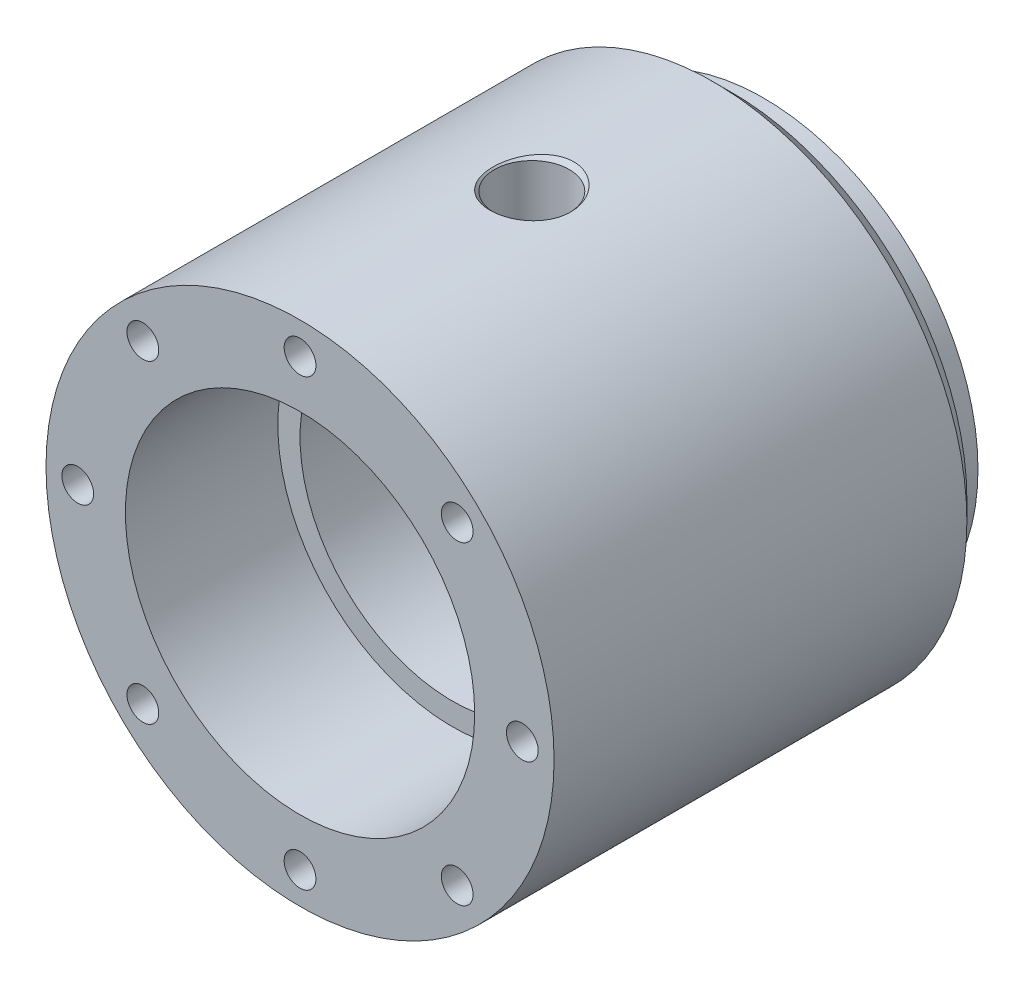
ISO-10303-21;
HEADER;
FILE_DESCRIPTION(('STEP AP214'),'2;1');
FILE_NAME('part.step','',(''),(''),'','','');
FILE_SCHEMA(('AUTOMOTIVE_DESIGN { 1 0 10303 214 1 1 1 1 }'));
ENDSEC;
DATA;
#1=APPLICATION_CONTEXT('core data for automotive mechanical design processes');
#2=APPLICATION_PROTOCOL_DEFINITION('international standard','automotive_design',2000,#1);
#3=PRODUCT_CONTEXT('',#1,'mechanical');
#4=PRODUCT('Part','Part','',(#3));
#5=PRODUCT_RELATED_PRODUCT_CATEGORY('part','',(#4));
#6=PRODUCT_DEFINITION_FORMATION('','',#4);
#7=PRODUCT_DEFINITION_CONTEXT('part definition',#1,'design');
#8=PRODUCT_DEFINITION('design','',#6,#7);
#9=PRODUCT_DEFINITION_SHAPE('','',#8);
#10=(LENGTH_UNIT() NAMED_UNIT(*) SI_UNIT(.MILLI.,.METRE.));
#11=(NAMED_UNIT(*) PLANE_ANGLE_UNIT() SI_UNIT($,.RADIAN.));
#12=(NAMED_UNIT(*) SI_UNIT($,.STERADIAN.) SOLID_ANGLE_UNIT());
#13=UNCERTAINTY_MEASURE_WITH_UNIT(LENGTH_MEASURE(1.E-05),#10,'distance_accuracy_value','');
#14=(GEOMETRIC_REPRESENTATION_CONTEXT(3) GLOBAL_UNCERTAINTY_ASSIGNED_CONTEXT((#13)) GLOBAL_UNIT_ASSIGNED_CONTEXT((#10,
#11,#12)) REPRESENTATION_CONTEXT('',''));
#15=CARTESIAN_POINT('',(0.,0.,0.));
#16=DIRECTION('',(0.,0.,1.));
#17=DIRECTION('',(1.,0.,0.));
#18=AXIS2_PLACEMENT_3D('',#15,#16,#17);
#19=CARTESIAN_POINT('',(0.,0.,-212.));
#20=DIRECTION('',(0.,0.,1.));
#21=DIRECTION('',(1.,0.,0.));
#22=AXIS2_PLACEMENT_3D('',#19,#20,#21);
#23=CONICAL_SURFACE('',#22,40.,0.785398163397448);
#24=CARTESIAN_POINT('',(0.,0.,-215.));
#25=DIRECTION('',(0.,0.,1.));
#26=DIRECTION('',(1.,0.,0.));
#27=AXIS2_PLACEMENT_3D('',#24,#25,#26);
#28=CIRCLE('',#27,36.9999999999999);
#29=CARTESIAN_POINT('',(36.9999999999999,0.,-215.));
#30=VERTEX_POINT('',#29);
#31=EDGE_CURVE('E132',#30,#30,#28,.T.);
#32=ORIENTED_EDGE('',*,*,#31,.T.);
#33=EDGE_LOOP('',(#32));
#34=FACE_BOUND('',#33,.T.);
#35=CARTESIAN_POINT('',(0.,0.,-212.));
#36=DIRECTION('',(0.,0.,1.));
#37=DIRECTION('',(1.,0.,0.));
#38=AXIS2_PLACEMENT_3D('',#35,#36,#37);
#39=CIRCLE('',#38,40.);
#40=CARTESIAN_POINT('',(40.,0.,-212.));
#41=VERTEX_POINT('',#40);
#42=EDGE_CURVE('E55',#41,#41,#39,.T.);
#43=ORIENTED_EDGE('',*,*,#42,.F.);
#44=EDGE_LOOP('',(#43));
#45=FACE_BOUND('',#44,.T.);
#46=ADVANCED_FACE('F44',(#34,#45),#23,.T.);
#47=CARTESIAN_POINT('',(0.,0.,0.));
#48=DIRECTION('',(0.,0.,1.));
#49=DIRECTION('',(1.,0.,0.));
#50=AXIS2_PLACEMENT_3D('',#47,#48,#49);
#51=CYLINDRICAL_SURFACE('',#50,40.);
#52=CARTESIAN_POINT('',(-4.46134364212804,39.7504265757624,-188.024245332228));
#53=CARTESIAN_POINT('',(-4.2547141816658,39.7736161133025,-188.260572684038));
#54=CARTESIAN_POINT('',(-4.03082984463506,39.797113352208,-188.48179628135));
#55=CARTESIAN_POINT('',(-3.55216918402587,39.8426890440379,-188.8882788173));
#56=CARTESIAN_POINT('',(-3.297383191654,39.8647670495763,-189.073526452043));
#57=CARTESIAN_POINT('',(-2.72878346440296,39.9079497616791,-189.422552239188));
#58=CARTESIAN_POINT('',(-2.41156349817063,39.9286015775349,-189.580895861088));
#59=CARTESIAN_POINT('',(-1.75334984843986,39.9629092170703,-189.837819123665));
#60=CARTESIAN_POINT('',(-1.41235991328911,39.97656614097,-189.936408163532));
#61=CARTESIAN_POINT('',(-0.742271126527992,39.9944170464418,-190.064261687959));
#62=CARTESIAN_POINT('',(-0.41402271225562,39.9992090253901,-190.097914263758));
#63=CARTESIAN_POINT('',(0.243290831804951,40.0006087912287,-190.10779993532));
#64=CARTESIAN_POINT('',(0.572355665170004,39.9972192082096,-190.084051483533));
#65=CARTESIAN_POINT('',(1.20896924388255,39.9829471995885,-189.982255893571));
#66=CARTESIAN_POINT('',(1.5168613929282,39.9723522037988,-189.906290525314));
#67=CARTESIAN_POINT('',(2.11590653727902,39.9451239650923,-189.705405311372));
#68=CARTESIAN_POINT('',(2.40705802944452,39.9284901809317,-189.580481077528));
#69=CARTESIAN_POINT('',(2.97290995866227,39.890404842453,-189.282484526864));
#70=CARTESIAN_POINT('',(3.24698613284484,39.86883930596,-189.108245181803));
#71=CARTESIAN_POINT('',(3.76426884044054,39.8233328554193,-188.719078872961));
#72=CARTESIAN_POINT('',(4.00746686594397,39.7993912899237,-188.504140735837));
#73=CARTESIAN_POINT('',(4.47398735437385,39.7497456637844,-188.023946737192));
#74=CARTESIAN_POINT('',(4.69479203835397,39.724033645806,-187.75624673313));
#75=CARTESIAN_POINT('',(5.09191527121395,39.6750870050078,-187.189484067489));
#76=CARTESIAN_POINT('',(5.2682194534872,39.6518531836468,-186.890411321487));
#77=CARTESIAN_POINT('',(5.58430448623184,39.6086215986105,-186.246464763901));
#78=CARTESIAN_POINT('',(5.72058312653403,39.58897287278,-185.899845636628));
#79=CARTESIAN_POINT('',(5.93627220436257,39.5572065919993,-185.189013216111));
#80=CARTESIAN_POINT('',(6.01566930939089,39.5450908027866,-184.824795819338));
#81=CARTESIAN_POINT('',(6.11841965191092,39.5293292024138,-184.071892330637));
#82=CARTESIAN_POINT('',(6.13914037442043,39.5260814739157,-183.682836304256));
#83=CARTESIAN_POINT('',(6.11663547782751,39.5295695472691,-182.906592947823));
#84=CARTESIAN_POINT('',(6.07340167148822,39.5363066273414,-182.519405863393));
#85=CARTESIAN_POINT('',(5.92284104234674,39.5591430587532,-181.752874868312));
#86=CARTESIAN_POINT('',(5.81471628347002,39.5753589006642,-181.373690477837));
#87=CARTESIAN_POINT('',(5.53579255499811,39.6153346761331,-180.639451279513));
#88=CARTESIAN_POINT('',(5.3649915724394,39.6390948519879,-180.284397247089));
#89=CARTESIAN_POINT('',(4.96747134394483,39.6908504739135,-179.615233176384));
#90=CARTESIAN_POINT('',(4.74171129119167,39.7187703811253,-179.300548965661));
#91=CARTESIAN_POINT('',(4.23778291698224,39.7756865573392,-178.716372932709));
#92=CARTESIAN_POINT('',(3.95962889112602,39.8046825310096,-178.446868820994));
#93=CARTESIAN_POINT('',(3.37387314712637,39.8584834794532,-177.976679551526));
#94=CARTESIAN_POINT('',(3.06860478247559,39.8834289615974,-177.773109984601));
#95=CARTESIAN_POINT('',(2.42569108996126,39.9276774927417,-177.425033858409));
#96=CARTESIAN_POINT('',(2.08806586484318,39.9469840153307,-177.280490916903));
#97=CARTESIAN_POINT('',(1.41873013965092,39.9761235806351,-177.066330809292));
#98=CARTESIAN_POINT('',(1.08864441200703,39.9865824870408,-176.991713216379));
#99=CARTESIAN_POINT('',(0.420353911500709,39.999184523368,-176.902104061656));
#100=CARTESIAN_POINT('',(0.0821524470286135,40.0013309858129,-176.887088604826));
#101=CARTESIAN_POINT('',(-0.572371428752767,39.9971691604508,-176.916500055854));
#102=CARTESIAN_POINT('',(-0.888851527944951,39.9913311376005,-176.957620456177));
#103=CARTESIAN_POINT('',(-1.51036439405873,39.9726842879224,-177.091726652953));
#104=CARTESIAN_POINT('',(-1.8153973391307,39.9598755696267,-177.184711641888));
#105=CARTESIAN_POINT('',(-2.40748261943061,39.9285922357563,-177.419379167752));
#106=CARTESIAN_POINT('',(-2.69443749739054,39.910089629769,-177.561302705151));
#107=CARTESIAN_POINT('',(-3.24206572620764,39.8693433687359,-177.888572987024));
#108=CARTESIAN_POINT('',(-3.50273316694451,39.8470988753995,-178.073929465393));
#109=CARTESIAN_POINT('',(-4.00693498883101,39.7996531153112,-178.494188195738));
#110=CARTESIAN_POINT('',(-4.24856676591587,39.7743549429052,-178.731359355045));
#111=CARTESIAN_POINT('',(-4.69189073590679,39.7245017768864,-179.2405171025));
#112=CARTESIAN_POINT('',(-4.89356981559064,39.6999470295123,-179.512515073393));
#113=CARTESIAN_POINT('',(-5.26706236266682,39.6521906558315,-180.10547174891));
#114=CARTESIAN_POINT('',(-5.43551069791807,39.6292278606958,-180.428571259433));
#115=CARTESIAN_POINT('',(-5.71932720896481,39.5892648752238,-181.097631060611));
#116=CARTESIAN_POINT('',(-5.83468188164498,39.5722662019815,-181.44359714128));
#117=CARTESIAN_POINT('',(-6.01518059579964,39.5452463765131,-182.168961336997));
#118=CARTESIAN_POINT('',(-6.07721661785063,39.5356600554306,-182.549151850767));
#119=CARTESIAN_POINT('',(-6.13886246858546,39.5261348382669,-183.314740793126));
#120=CARTESIAN_POINT('',(-6.13845604353093,39.5261984540596,-183.700140551575));
#121=CARTESIAN_POINT('',(-6.07447984363853,39.5360820489496,-184.474387912181));
#122=CARTESIAN_POINT('',(-6.00947532051334,39.546123642294,-184.863114931827));
#123=CARTESIAN_POINT('',(-5.81537609752857,39.5751307034205,-185.623824159913));
#124=CARTESIAN_POINT('',(-5.68630635411572,39.5940926961332,-185.995812827243));
#125=CARTESIAN_POINT('',(-5.3913346070961,39.6352362027509,-186.656771626619));
#126=CARTESIAN_POINT('',(-5.23413864760716,39.656475418107,-186.949715672503));
#127=CARTESIAN_POINT('',(-4.87812840639666,39.7018389231571,-187.508781471973));
#128=CARTESIAN_POINT('',(-4.67933866144232,39.7259615083291,-187.774918902652));
#129=CARTESIAN_POINT('',(-4.46134364212804,39.7504265757624,-188.024245332228));
#130=B_SPLINE_CURVE_WITH_KNOTS('',3,(#52,#53,#54,#55,#56,#57,#58,#59,#60,#61,#62,#63,#64,#65,
#66,#67,#68,#69,#70,#71,#72,#73,#74,#75,#76,#77,#78,#79,#80,#81,#82,#83,#84,#85,#86,#87,#88,#89,
#90,#91,#92,#93,#94,#95,#96,#97,#98,#99,#100,#101,#102,#103,#104,#105,#106,#107,#108,#109,#110,
#111,#112,#113,#114,#115,#116,#117,#118,#119,#120,#121,#122,#123,#124,#125,#126,#127,#128,#129),
.UNSPECIFIED.,.T.,.F.,(4,2,2,2,2,2,2,2,2,2,2,2,2,2,2,2,2,2,2,2,2,2,2,2,2,2,2,2,2,2,2,2,2,2,2,2,
2,2,4),(0.,0.94343591868034,1.88716779348964,2.94685438130871,4.00637424079321,4.991375257964,
5.9760596733945,6.92360470319653,7.87123468040898,8.84349454804731,9.81602172545094,
10.855443765681,11.8952009464558,13.0091235132354,14.1233070876646,15.2867422170085,
16.4503262981701,17.6285203429932,18.8067522310221,19.9657340007881,21.1244000013531,
22.2218280488545,23.3185786499776,24.3290355264355,25.3390872608983,26.2921419633272,
27.2451818273505,28.2029836456833,29.1610003256898,30.1752267773706,31.1897855675944,
32.2802803579052,33.3710523366913,34.5217731889344,35.6727935737584,36.8499630778545,
38.0266743779664,39.0225894137229,40.0179185930879),.UNSPECIFIED.);
#131=CARTESIAN_POINT('',(-4.46134364212804,39.7504265757624,-188.024245332228));
#132=VERTEX_POINT('',#131);
#133=EDGE_CURVE('E12',#132,#132,#130,.T.);
#134=ORIENTED_EDGE('',*,*,#133,.T.);
#135=EDGE_LOOP('',(#134));
#136=FACE_BOUND('',#135,.T.);
#137=CARTESIAN_POINT('',(0.,0.,-147.));
#138=DIRECTION('',(0.,0.,1.));
#139=DIRECTION('',(1.,0.,0.));
#140=AXIS2_PLACEMENT_3D('',#137,#138,#139);
#141=CIRCLE('',#140,40.);
#142=CARTESIAN_POINT('',(40.,0.,-147.));
#143=VERTEX_POINT('',#142);
#144=EDGE_CURVE('E218',#143,#143,#141,.T.);
#145=ORIENTED_EDGE('',*,*,#144,.F.);
#146=EDGE_LOOP('',(#145));
#147=FACE_BOUND('',#146,.T.);
#148=ORIENTED_EDGE('',*,*,#42,.T.);
#149=EDGE_LOOP('',(#148));
#150=FACE_BOUND('',#149,.T.);
#151=ADVANCED_FACE('F205',(#136,#147,#150),#51,.T.);
#152=CARTESIAN_POINT('',(0.,0.,-147.));
#153=DIRECTION('',(0.,0.,1.));
#154=DIRECTION('',(1.,0.,0.));
#155=AXIS2_PLACEMENT_3D('',#152,#153,#154);
#156=PLANE('',#155);
#157=CARTESIAN_POINT('',(-24.7487373415292,24.7487373415292,-147.));
#158=DIRECTION('',(0.,0.,1.));
#159=DIRECTION('',(1.,0.,0.));
#160=AXIS2_PLACEMENT_3D('',#157,#158,#159);
#161=CIRCLE('',#160,2.49999999999999);
#162=CARTESIAN_POINT('',(-22.2487373415292,24.7487373415292,-147.));
#163=VERTEX_POINT('',#162);
#164=EDGE_CURVE('E290',#163,#163,#161,.T.);
#165=ORIENTED_EDGE('',*,*,#164,.F.);
#166=EDGE_LOOP('',(#165));
#167=FACE_BOUND('',#166,.T.);
#168=CARTESIAN_POINT('',(0.,35.,-147.));
#169=DIRECTION('',(0.,0.,1.));
#170=DIRECTION('',(1.,0.,0.));
#171=AXIS2_PLACEMENT_3D('',#168,#169,#170);
#172=CIRCLE('',#171,2.49999999999999);
#173=CARTESIAN_POINT('',(2.49999999999999,35.,-147.));
#174=VERTEX_POINT('',#173);
#175=EDGE_CURVE('E294',#174,#174,#172,.T.);
#176=ORIENTED_EDGE('',*,*,#175,.F.);
#177=EDGE_LOOP('',(#176));
#178=FACE_BOUND('',#177,.T.);
#179=CARTESIAN_POINT('',(24.7487373415289,24.7487373415295,-147.));
#180=DIRECTION('',(0.,0.,1.));
#181=DIRECTION('',(1.,0.,0.));
#182=AXIS2_PLACEMENT_3D('',#179,#180,#181);
#183=CIRCLE('',#182,2.49999999999999);
#184=CARTESIAN_POINT('',(27.2487373415289,24.7487373415295,-147.));
#185=VERTEX_POINT('',#184);
#186=EDGE_CURVE('E298',#185,#185,#183,.T.);
#187=ORIENTED_EDGE('',*,*,#186,.F.);
#188=EDGE_LOOP('',(#187));
#189=FACE_BOUND('',#188,.T.);
#190=CARTESIAN_POINT('',(35.,3.33066907387547E-13,-147.));
#191=DIRECTION('',(0.,0.,1.));
#192=DIRECTION('',(1.,0.,0.));
#193=AXIS2_PLACEMENT_3D('',#190,#191,#192);
#194=CIRCLE('',#193,2.49999999999999);
#195=CARTESIAN_POINT('',(37.5,3.33066907387547E-13,-147.));
#196=VERTEX_POINT('',#195);
#197=EDGE_CURVE('E91',#196,#196,#194,.T.);
#198=ORIENTED_EDGE('',*,*,#197,.F.);
#199=EDGE_LOOP('',(#198));
#200=FACE_BOUND('',#199,.T.);
#201=CARTESIAN_POINT('',(24.7487373415294,-24.7487373415289,-147.));
#202=DIRECTION('',(0.,0.,1.));
#203=DIRECTION('',(1.,0.,0.));
#204=AXIS2_PLACEMENT_3D('',#201,#202,#203);
#205=CIRCLE('',#204,2.49999999999999);
#206=CARTESIAN_POINT('',(27.2487373415294,-24.7487373415289,-147.));
#207=VERTEX_POINT('',#206);
#208=EDGE_CURVE('E90',#207,#207,#205,.T.);
#209=ORIENTED_EDGE('',*,*,#208,.F.);
#210=EDGE_LOOP('',(#209));
#211=FACE_BOUND('',#210,.T.);
#212=CARTESIAN_POINT('',(0.,-35.,-147.));
#213=DIRECTION('',(0.,0.,1.));
#214=DIRECTION('',(1.,0.,0.));
#215=AXIS2_PLACEMENT_3D('',#212,#213,#214);
#216=CIRCLE('',#215,2.49999999999999);
#217=CARTESIAN_POINT('',(2.49999999999999,-35.,-147.));
#218=VERTEX_POINT('',#217);
#219=EDGE_CURVE('E103',#218,#218,#216,.T.);
#220=ORIENTED_EDGE('',*,*,#219,.F.);
#221=EDGE_LOOP('',(#220));
#222=FACE_BOUND('',#221,.T.);
#223=CARTESIAN_POINT('',(-24.748737341529,-24.7487373415293,-147.));
#224=DIRECTION('',(0.,0.,1.));
#225=DIRECTION('',(1.,0.,0.));
#226=AXIS2_PLACEMENT_3D('',#223,#224,#225);
#227=CIRCLE('',#226,2.49999999999999);
#228=CARTESIAN_POINT('',(-22.248737341529,-24.7487373415293,-147.));
#229=VERTEX_POINT('',#228);
#230=EDGE_CURVE('E109',#229,#229,#227,.T.);
#231=ORIENTED_EDGE('',*,*,#230,.F.);
#232=EDGE_LOOP('',(#231));
#233=FACE_BOUND('',#232,.T.);
#234=CARTESIAN_POINT('',(-35.,-1.11022302462516E-13,-147.));
#235=DIRECTION('',(0.,0.,1.));
#236=DIRECTION('',(1.,0.,0.));
#237=AXIS2_PLACEMENT_3D('',#234,#235,#236);
#238=CIRCLE('',#237,2.49999999999999);
#239=CARTESIAN_POINT('',(-32.5,-1.11022302462516E-13,-147.));
#240=VERTEX_POINT('',#239);
#241=EDGE_CURVE('E115',#240,#240,#238,.T.);
#242=ORIENTED_EDGE('',*,*,#241,.F.);
#243=EDGE_LOOP('',(#242));
#244=FACE_BOUND('',#243,.T.);
#245=ORIENTED_EDGE('',*,*,#144,.T.);
#246=EDGE_LOOP('',(#245));
#247=FACE_BOUND('',#246,.T.);
#248=CARTESIAN_POINT('',(0.,0.,-147.));
#249=DIRECTION('',(0.,0.,1.));
#250=DIRECTION('',(1.,0.,0.));
#251=AXIS2_PLACEMENT_3D('',#248,#249,#250);
#252=CIRCLE('',#251,27.5);
#253=CARTESIAN_POINT('',(27.5,0.,-147.));
#254=VERTEX_POINT('',#253);
#255=EDGE_CURVE('E220',#254,#254,#252,.T.);
#256=ORIENTED_EDGE('',*,*,#255,.F.);
#257=EDGE_LOOP('',(#256));
#258=FACE_BOUND('',#257,.T.);
#259=ADVANCED_FACE('F210',(#167,#178,#189,#200,#211,#222,#233,#244,#247,#258),#156,.T.);
#260=CARTESIAN_POINT('',(0.,0.,0.));
#261=DIRECTION('',(0.,0.,1.));
#262=DIRECTION('',(1.,0.,0.));
#263=AXIS2_PLACEMENT_3D('',#260,#261,#262);
#264=CYLINDRICAL_SURFACE('',#263,27.5);
#265=ORIENTED_EDGE('',*,*,#255,.T.);
#266=EDGE_LOOP('',(#265));
#267=FACE_BOUND('',#266,.T.);
#268=CARTESIAN_POINT('',(0.,0.,-171.));
#269=DIRECTION('',(0.,0.,1.));
#270=DIRECTION('',(1.,0.,0.));
#271=AXIS2_PLACEMENT_3D('',#268,#269,#270);
#272=CIRCLE('',#271,27.5);
#273=CARTESIAN_POINT('',(27.5,0.,-171.));
#274=VERTEX_POINT('',#273);
#275=EDGE_CURVE('E225',#274,#274,#272,.T.);
#276=ORIENTED_EDGE('',*,*,#275,.F.);
#277=EDGE_LOOP('',(#276));
#278=FACE_BOUND('',#277,.T.);
#279=ADVANCED_FACE('F277',(#267,#278),#264,.F.);
#280=CARTESIAN_POINT('',(0.,0.,-171.));
#281=DIRECTION('',(0.,0.,1.));
#282=DIRECTION('',(1.,0.,0.));
#283=AXIS2_PLACEMENT_3D('',#280,#281,#282);
#284=PLANE('',#283);
#285=ORIENTED_EDGE('',*,*,#275,.T.);
#286=EDGE_LOOP('',(#285));
#287=FACE_BOUND('',#286,.T.);
#288=CARTESIAN_POINT('',(0.,0.,-171.));
#289=DIRECTION('',(0.,0.,1.));
#290=DIRECTION('',(1.,0.,0.));
#291=AXIS2_PLACEMENT_3D('',#288,#289,#290);
#292=CIRCLE('',#291,24.);
#293=CARTESIAN_POINT('',(24.,0.,-171.));
#294=VERTEX_POINT('',#293);
#295=EDGE_CURVE('E228',#294,#294,#292,.T.);
#296=ORIENTED_EDGE('',*,*,#295,.F.);
#297=EDGE_LOOP('',(#296));
#298=FACE_BOUND('',#297,.T.);
#299=ADVANCED_FACE('F273',(#287,#298),#284,.T.);
#300=CARTESIAN_POINT('',(0.,0.,0.));
#301=DIRECTION('',(0.,0.,1.));
#302=DIRECTION('',(1.,0.,0.));
#303=AXIS2_PLACEMENT_3D('',#300,#301,#302);
#304=CYLINDRICAL_SURFACE('',#303,24.);
#305=CARTESIAN_POINT('',(0.,24.,-177.6));
#306=CARTESIAN_POINT('',(-0.163129915506218,24.0000028132944,-177.599995294577));
#307=CARTESIAN_POINT('',(-0.326207717534748,23.9983342797377,-177.606766678122));
#308=CARTESIAN_POINT('',(-0.651222505127987,23.9917129191338,-177.633784773802));
#309=CARTESIAN_POINT('',(-0.813159352422645,23.9867597007125,-177.65403309173));
#310=CARTESIAN_POINT('',(-1.13472108947393,23.9737006996918,-177.707850145103));
#311=CARTESIAN_POINT('',(-1.2943452008249,23.9655938801179,-177.741423262112));
#312=CARTESIAN_POINT('',(-1.61016174790263,23.946448858497,-177.821626122152));
#313=CARTESIAN_POINT('',(-1.76635289624406,23.935409576399,-177.868260676165));
#314=CARTESIAN_POINT('',(-2.07391440871933,23.9107224205778,-177.974125462135));
#315=CARTESIAN_POINT('',(-2.22529196558344,23.897078675106,-178.033335777164));
#316=CARTESIAN_POINT('',(-2.52251988635818,23.8675346136456,-178.163966290261));
#317=CARTESIAN_POINT('',(-2.6683681854701,23.8516334649866,-178.235390995751));
#318=CARTESIAN_POINT('',(-2.95346929636076,23.8180103697754,-178.389882823223));
#319=CARTESIAN_POINT('',(-3.09272453059606,23.8002890996866,-178.472945623961));
#320=CARTESIAN_POINT('',(-3.36385617090346,23.7634845694718,-178.650184140514));
#321=CARTESIAN_POINT('',(-3.49572977758218,23.7444007987939,-178.74436403082));
#322=CARTESIAN_POINT('',(-3.75345424981967,23.7050389889185,-178.944924986923));
#323=CARTESIAN_POINT('',(-3.87915874305194,23.68474586541,-179.051491222318));
#324=CARTESIAN_POINT('',(-4.12123392279909,23.6438260251319,-179.274771567204));
#325=CARTESIAN_POINT('',(-4.23760112924469,23.623199187395,-179.391489426807));
#326=CARTESIAN_POINT('',(-4.46015810932026,23.5821922870531,-179.634240435427));
#327=CARTESIAN_POINT('',(-4.56635048856046,23.5618121624431,-179.76027118484));
#328=CARTESIAN_POINT('',(-4.76791600074094,23.5218524051322,-180.020901409619));
#329=CARTESIAN_POINT('',(-4.86328512557815,23.5022730706881,-180.155504030728));
#330=CARTESIAN_POINT('',(-5.04375052343918,23.4642112178049,-180.43429707519));
#331=CARTESIAN_POINT('',(-5.12868458666207,23.4457478539,-180.57859520958));
#332=CARTESIAN_POINT('',(-5.28609767575041,23.4107598097115,-180.874125237712));
#333=CARTESIAN_POINT('',(-5.35857199425946,23.3942358628945,-181.025359724829));
#334=CARTESIAN_POINT('',(-5.49042751433532,23.3636427227346,-181.333604863336));
#335=CARTESIAN_POINT('',(-5.54981514954815,23.3495723238971,-181.49061263198));
#336=CARTESIAN_POINT('',(-5.65507168593229,23.3243016418964,-181.80931830707));
#337=CARTESIAN_POINT('',(-5.70093573988469,23.3131023880168,-181.97101787243));
#338=CARTESIAN_POINT('',(-5.81603157775991,23.2847657021181,-182.455052562145));
#339=CARTESIAN_POINT('',(-5.86549410808553,23.2722329632817,-182.782728391959));
#340=CARTESIAN_POINT('',(-5.89809288029315,23.2639732869158,-183.276599502325));
#341=CARTESIAN_POINT('',(-5.90202009599111,23.2629782900436,-183.441680409218));
#342=CARTESIAN_POINT('',(-5.89605233319406,23.2644919502164,-183.771596301258));
#343=CARTESIAN_POINT('',(-5.88615721078497,23.2670006437407,-183.936431283827));
#344=CARTESIAN_POINT('',(-5.8365574457495,23.2795189835014,-184.42093471402));
#345=CARTESIAN_POINT('',(-5.77744861893462,23.2943942858077,-184.738707989739));
#346=CARTESIAN_POINT('',(-5.6085521973749,23.3356280752064,-185.359514958059));
#347=CARTESIAN_POINT('',(-5.49876109881415,23.3619873562132,-185.662547629997));
#348=CARTESIAN_POINT('',(-5.23051733708409,23.4235080943241,-186.248928033263));
#349=CARTESIAN_POINT('',(-5.07159822045178,23.4587533016005,-186.532053685848));
#350=CARTESIAN_POINT('',(-4.70993638421948,23.5340289184464,-187.068066070503));
#351=CARTESIAN_POINT('',(-4.50718623015131,23.5740601392874,-187.320947661364));
#352=CARTESIAN_POINT('',(-4.05699432887059,23.6557487069486,-187.796619027236));
#353=CARTESIAN_POINT('',(-3.80847568552035,23.6974204778503,-188.018388451347));
#354=CARTESIAN_POINT('',(-3.27727934629278,23.7766995839607,-188.417292532521));
#355=CARTESIAN_POINT('',(-2.99460067410034,23.8143068029438,-188.594425913411));
#356=CARTESIAN_POINT('',(-2.40168218827118,23.8813966875209,-188.899388085473));
#357=CARTESIAN_POINT('',(-2.09135623533584,23.9108526970047,-189.027055645479));
#358=CARTESIAN_POINT('',(-1.45276337068458,23.9581269901585,-189.228130547392));
#359=CARTESIAN_POINT('',(-1.12449978622294,23.975947424226,-189.301547915733));
#360=CARTESIAN_POINT('',(-0.468078408307355,23.9976261574395,-189.39049053682));
#361=CARTESIAN_POINT('',(-0.140119779983527,24.0018196711449,-189.407406002231));
#362=CARTESIAN_POINT('',(0.513941261900706,23.9967246557784,-189.386671219104));
#363=CARTESIAN_POINT('',(0.840043834204747,23.9874372976289,-189.349025709628));
#364=CARTESIAN_POINT('',(1.47633643217034,23.9566384644989,-189.22138496837));
#365=CARTESIAN_POINT('',(1.78668707832861,23.9353032313092,-189.132144058406));
#366=CARTESIAN_POINT('',(2.38799999904552,23.8828103642605,-188.904702765358));
#367=CARTESIAN_POINT('',(2.67896035039195,23.8516517578286,-188.766497534345));
#368=CARTESIAN_POINT('',(3.23879413132204,23.7821619476272,-188.442332619336));
#369=CARTESIAN_POINT('',(3.50719899812563,23.7437161014023,-188.255588978874));
#370=CARTESIAN_POINT('',(4.00935951818062,23.6641033815454,-187.840638155133));
#371=CARTESIAN_POINT('',(4.24310938827491,23.6229360554119,-187.612424065459));
#372=CARTESIAN_POINT('',(4.67500429320732,23.5413224361716,-187.114626480352));
#373=CARTESIAN_POINT('',(4.87217536373011,23.5009162881383,-186.844191478391));
#374=CARTESIAN_POINT('',(5.21837685143338,23.4264824895959,-186.273059212131));
#375=CARTESIAN_POINT('',(5.36740941804766,23.3924545543215,-185.972363299799));
#376=CARTESIAN_POINT('',(5.55092073222781,23.3493279981814,-185.506262442067));
#377=CARTESIAN_POINT('',(5.60533272112777,23.3362942416547,-185.348793792098));
#378=CARTESIAN_POINT('',(5.70069298747207,23.3131835974688,-185.029635238342));
#379=CARTESIAN_POINT('',(5.74164635101061,23.3031055929686,-184.867946954171));
#380=CARTESIAN_POINT('',(5.80973651318506,23.2862231629239,-184.541524756696));
#381=CARTESIAN_POINT('',(5.83687298703343,23.2794188143319,-184.376790771893));
#382=CARTESIAN_POINT('',(5.87709537871109,23.2692970125136,-184.045511983136));
#383=CARTESIAN_POINT('',(5.89018194269747,23.265979398932,-183.878967262814));
#384=CARTESIAN_POINT('',(5.90202024691639,23.2629789784072,-183.549971914355));
#385=CARTESIAN_POINT('',(5.90115987952904,23.2631978150893,-183.387535992571));
#386=CARTESIAN_POINT('',(5.88605574911327,23.2670240598764,-183.063330395313));
#387=CARTESIAN_POINT('',(5.87181228512983,23.2706313922654,-182.901560705034));
#388=CARTESIAN_POINT('',(5.83005999963052,23.2811267381282,-182.57982643052));
#389=CARTESIAN_POINT('',(5.80254912438193,23.2880152595125,-182.419862129676));
#390=CARTESIAN_POINT('',(5.734502552541,23.304864439104,-182.102954266502));
#391=CARTESIAN_POINT('',(5.69397145036715,23.3148240135859,-181.946009659295));
#392=CARTESIAN_POINT('',(5.60045511480783,23.3374634829506,-181.636984447276));
#393=CARTESIAN_POINT('',(5.54753637714288,23.3501288228704,-181.484882633638));
#394=CARTESIAN_POINT('',(5.42955770412746,23.37784358698,-181.185751877795));
#395=CARTESIAN_POINT('',(5.36450198767395,23.3928921824601,-181.038721193809));
#396=CARTESIAN_POINT('',(5.22268137527553,23.4249628361152,-180.750564033233));
#397=CARTESIAN_POINT('',(5.14591124764835,23.4419857752175,-180.609440230732));
#398=CARTESIAN_POINT('',(4.98124751660377,23.4775267474837,-180.334104092417));
#399=CARTESIAN_POINT('',(4.89335757628791,23.4960442875703,-180.199889500953));
#400=CARTESIAN_POINT('',(4.70462923472382,23.5345697309099,-179.935806745681));
#401=CARTESIAN_POINT('',(4.60351658359744,23.5546036754535,-179.806138299519));
#402=CARTESIAN_POINT('',(4.39090699790525,23.5951613763628,-179.555776571406));
#403=CARTESIAN_POINT('',(4.27941361458397,23.6156849634478,-179.435080245324));
#404=CARTESIAN_POINT('',(4.0466771868203,23.6566770673216,-179.203328280832));
#405=CARTESIAN_POINT('',(3.92542842404088,23.6771455444347,-179.092278377374));
#406=CARTESIAN_POINT('',(3.6740728152301,23.7174488827699,-178.880674435562));
#407=CARTESIAN_POINT('',(3.54396921303327,23.7372839721532,-178.780116587437));
#408=CARTESIAN_POINT('',(3.27331940366536,23.7761307810354,-178.588446117445));
#409=CARTESIAN_POINT('',(3.13262869451466,23.7951216005927,-178.497533135626));
#410=CARTESIAN_POINT('',(2.84391305561172,23.8313515914488,-178.327942368803));
#411=CARTESIAN_POINT('',(2.69589085011769,23.8485914062336,-178.249260083395));
#412=CARTESIAN_POINT('',(2.39354656322985,23.8808295724216,-178.104725318124));
#413=CARTESIAN_POINT('',(2.23922733884581,23.8958289262556,-178.038867096469));
#414=CARTESIAN_POINT('',(1.92538329774703,23.9231633073251,-177.920479922854));
#415=CARTESIAN_POINT('',(1.76585929108086,23.9354987469045,-177.867948907772));
#416=CARTESIAN_POINT('',(1.344085750603,23.9637480801967,-177.748788750579));
#417=CARTESIAN_POINT('',(1.07849813491825,23.9772591081101,-177.693087827178));
#418=CARTESIAN_POINT('',(0.541892195373963,23.9953824199924,-177.618698657509));
#419=CARTESIAN_POINT('',(0.270874254052526,23.999995328576,-177.600007813269));
#420=CARTESIAN_POINT('',(0.,24.,-177.6));
#421=B_SPLINE_CURVE_WITH_KNOTS('',3,(#305,#306,#307,#308,#309,#310,#311,#312,#313,#314,#315,
#316,#317,#318,#319,#320,#321,#322,#323,#324,#325,#326,#327,#328,#329,#330,#331,#332,#333,#334,
#335,#336,#337,#338,#339,#340,#341,#342,#343,#344,#345,#346,#347,#348,#349,#350,#351,#352,#353,
#354,#355,#356,#357,#358,#359,#360,#361,#362,#363,#364,#365,#366,#367,#368,#369,#370,#371,#372,
#373,#374,#375,#376,#377,#378,#379,#380,#381,#382,#383,#384,#385,#386,#387,#388,#389,#390,#391,
#392,#393,#394,#395,#396,#397,#398,#399,#400,#401,#402,#403,#404,#405,#406,#407,#408,#409,#410,
#411,#412,#413,#414,#415,#416,#417,#418,#419,#420),.UNSPECIFIED.,.T.,.F.,(4,2,2,2,2,2,2,2,2,2,2,
2,2,2,2,2,2,2,2,2,2,2,2,2,2,2,2,2,2,2,2,2,2,2,2,2,2,2,2,2,2,2,2,2,2,2,2,2,2,2,2,2,2,2,2,2,2,4),
(0.,0.489151133150437,0.978360559687353,1.4677309853629,1.9572819008229,2.44606319310756,
2.93502524898454,3.42380623116087,3.91277133896789,4.41032034667674,4.908053941104,
5.40565973134484,5.90344919939646,6.40819608501696,6.91313324955743,7.41782162144797,
7.92269066808297,8.91171824843664,9.40661503466333,9.90151697364644,10.8672729010914,
11.8330956041121,12.8083857466643,13.783841444514,14.7861572887415,15.7885017865645,
16.7940864266315,17.7994851696539,18.7799566433184,19.7603429602286,20.7267460384231,
21.6932448263805,22.6764453291064,23.6598097221451,24.6664553035043,25.6730559308856,
26.17388552637,26.6745256371565,27.175177515726,27.6758063682672,28.1625362036807,
28.649255163386,29.1360494890865,29.622672229096,30.1067404115597,30.5906406410671,
31.0747576174575,31.5587155286969,32.0550838998514,32.5512830831637,33.0477752740949,
33.5440865516692,34.0492189935985,34.5541651249033,35.0588846512513,35.5635259965846,
36.3758095669392,37.188036115944),.UNSPECIFIED.);
#422=CARTESIAN_POINT('',(0.,24.,-177.6));
#423=VERTEX_POINT('',#422);
#424=EDGE_CURVE('E124',#423,#423,#421,.T.);
#425=ORIENTED_EDGE('',*,*,#424,.F.);
#426=EDGE_LOOP('',(#425));
#427=FACE_BOUND('',#426,.T.);
#428=ORIENTED_EDGE('',*,*,#295,.T.);
#429=EDGE_LOOP('',(#428));
#430=FACE_BOUND('',#429,.T.);
#431=CARTESIAN_POINT('',(0.,0.,-196.));
#432=DIRECTION('',(0.,0.,1.));
#433=DIRECTION('',(1.,0.,0.));
#434=AXIS2_PLACEMENT_3D('',#431,#432,#433);
#435=CIRCLE('',#434,24.);
#436=CARTESIAN_POINT('',(24.,0.,-196.));
#437=VERTEX_POINT('',#436);
#438=EDGE_CURVE('E231',#437,#437,#435,.T.);
#439=ORIENTED_EDGE('',*,*,#438,.F.);
#440=EDGE_LOOP('',(#439));
#441=FACE_BOUND('',#440,.T.);
#442=ADVANCED_FACE('F267',(#427,#430,#441),#304,.F.);
#443=CARTESIAN_POINT('',(0.,0.,-196.));
#444=DIRECTION('',(0.,0.,-1.));
#445=DIRECTION('',(-1.,0.,0.));
#446=AXIS2_PLACEMENT_3D('',#443,#444,#445);
#447=PLANE('',#446);
#448=ORIENTED_EDGE('',*,*,#438,.T.);
#449=EDGE_LOOP('',(#448));
#450=FACE_BOUND('',#449,.T.);
#451=CARTESIAN_POINT('',(0.,0.,-196.));
#452=DIRECTION('',(0.,0.,1.));
#453=DIRECTION('',(1.,0.,0.));
#454=AXIS2_PLACEMENT_3D('',#451,#452,#453);
#455=CIRCLE('',#454,27.5);
#456=CARTESIAN_POINT('',(27.5,0.,-196.));
#457=VERTEX_POINT('',#456);
#458=EDGE_CURVE('E234',#457,#457,#455,.T.);
#459=ORIENTED_EDGE('',*,*,#458,.F.);
#460=EDGE_LOOP('',(#459));
#461=FACE_BOUND('',#460,.T.);
#462=ADVANCED_FACE('F261',(#450,#461),#447,.T.);
#463=CARTESIAN_POINT('',(0.,0.,0.));
#464=DIRECTION('',(0.,0.,1.));
#465=DIRECTION('',(1.,0.,0.));
#466=AXIS2_PLACEMENT_3D('',#463,#464,#465);
#467=CYLINDRICAL_SURFACE('',#466,27.5);
#468=ORIENTED_EDGE('',*,*,#458,.T.);
#469=EDGE_LOOP('',(#468));
#470=FACE_BOUND('',#469,.T.);
#471=CARTESIAN_POINT('',(0.,0.,-220.));
#472=DIRECTION('',(0.,0.,1.));
#473=DIRECTION('',(1.,0.,0.));
#474=AXIS2_PLACEMENT_3D('',#471,#472,#473);
#475=CIRCLE('',#474,27.5);
#476=CARTESIAN_POINT('',(27.5,0.,-220.));
#477=VERTEX_POINT('',#476);
#478=EDGE_CURVE('E237',#477,#477,#475,.T.);
#479=ORIENTED_EDGE('',*,*,#478,.F.);
#480=EDGE_LOOP('',(#479));
#481=FACE_BOUND('',#480,.T.);
#482=ADVANCED_FACE('F256',(#470,#481),#467,.F.);
#483=CARTESIAN_POINT('',(0.,0.,-220.));
#484=DIRECTION('',(0.,0.,1.));
#485=DIRECTION('',(1.,0.,0.));
#486=AXIS2_PLACEMENT_3D('',#483,#484,#485);
#487=PLANE('',#486);
#488=CARTESIAN_POINT('',(0.,0.,-220.));
#489=DIRECTION('',(0.,0.,1.));
#490=DIRECTION('',(1.,0.,0.));
#491=AXIS2_PLACEMENT_3D('',#488,#489,#490);
#492=CIRCLE('',#491,33.75);
#493=CARTESIAN_POINT('',(33.75,0.,-220.));
#494=VERTEX_POINT('',#493);
#495=EDGE_CURVE('E240',#494,#494,#492,.T.);
#496=ORIENTED_EDGE('',*,*,#495,.F.);
#497=EDGE_LOOP('',(#496));
#498=FACE_BOUND('',#497,.T.);
#499=ORIENTED_EDGE('',*,*,#478,.T.);
#500=EDGE_LOOP('',(#499));
#501=FACE_BOUND('',#500,.T.);
#502=ADVANCED_FACE('F250',(#498,#501),#487,.F.);
#503=CARTESIAN_POINT('',(0.,0.,0.));
#504=DIRECTION('',(0.,0.,1.));
#505=DIRECTION('',(1.,0.,0.));
#506=AXIS2_PLACEMENT_3D('',#503,#504,#505);
#507=CYLINDRICAL_SURFACE('',#506,33.75);
#508=CARTESIAN_POINT('',(0.,0.,-215.));
#509=DIRECTION('',(0.,0.,1.));
#510=DIRECTION('',(1.,0.,0.));
#511=AXIS2_PLACEMENT_3D('',#508,#509,#510);
#512=CIRCLE('',#511,33.75);
#513=CARTESIAN_POINT('',(33.75,0.,-215.));
#514=VERTEX_POINT('',#513);
#515=EDGE_CURVE('E242',#514,#514,#512,.T.);
#516=ORIENTED_EDGE('',*,*,#515,.F.);
#517=EDGE_LOOP('',(#516));
#518=FACE_BOUND('',#517,.T.);
#519=ORIENTED_EDGE('',*,*,#495,.T.);
#520=EDGE_LOOP('',(#519));
#521=FACE_BOUND('',#520,.T.);
#522=ADVANCED_FACE('F247',(#518,#521),#507,.T.);
#523=CARTESIAN_POINT('',(0.,0.,-215.));
#524=DIRECTION('',(0.,0.,1.));
#525=DIRECTION('',(1.,0.,0.));
#526=AXIS2_PLACEMENT_3D('',#523,#524,#525);
#527=PLANE('',#526);
#528=ORIENTED_EDGE('',*,*,#31,.F.);
#529=EDGE_LOOP('',(#528));
#530=FACE_BOUND('',#529,.T.);
#531=ORIENTED_EDGE('',*,*,#515,.T.);
#532=EDGE_LOOP('',(#531));
#533=FACE_BOUND('',#532,.T.);
#534=ADVANCED_FACE('F145',(#530,#533),#527,.F.);
#535=CARTESIAN_POINT('',(0.,40.,-183.5));
#536=DIRECTION('',(0.,1.,0.));
#537=DIRECTION('',(0.,0.,1.));
#538=AXIS2_PLACEMENT_3D('',#535,#536,#537);
#539=CONICAL_SURFACE('',#538,6.6035,0.78539816339745);
#540=CARTESIAN_POINT('',(0.,39.2965,-183.5));
#541=DIRECTION('',(0.,1.,0.));
#542=DIRECTION('',(0.,0.,1.));
#543=AXIS2_PLACEMENT_3D('',#540,#541,#542);
#544=CIRCLE('',#543,5.9);
#545=CARTESIAN_POINT('',(0.,39.2965,-177.6));
#546=VERTEX_POINT('',#545);
#547=EDGE_CURVE('E121',#546,#546,#544,.T.);
#548=ORIENTED_EDGE('',*,*,#547,.F.);
#549=EDGE_LOOP('',(#548));
#550=FACE_BOUND('',#549,.T.);
#551=ORIENTED_EDGE('',*,*,#133,.F.);
#552=EDGE_LOOP('',(#551));
#553=FACE_BOUND('',#552,.T.);
#554=ADVANCED_FACE('F140',(#550,#553),#539,.F.);
#555=CARTESIAN_POINT('',(0.,40.,-183.5));
#556=DIRECTION('',(0.,1.,0.));
#557=DIRECTION('',(0.,0.,1.));
#558=AXIS2_PLACEMENT_3D('',#555,#556,#557);
#559=CYLINDRICAL_SURFACE('',#558,5.9);
#560=ORIENTED_EDGE('',*,*,#547,.T.);
#561=EDGE_LOOP('',(#560));
#562=FACE_BOUND('',#561,.T.);
#563=ORIENTED_EDGE('',*,*,#424,.T.);
#564=EDGE_LOOP('',(#563));
#565=FACE_BOUND('',#564,.T.);
#566=ADVANCED_FACE('F136',(#562,#565),#559,.F.);
#567=CARTESIAN_POINT('',(-35.,-1.11022302462516E-13,-147.));
#568=DIRECTION('',(0.,0.,1.));
#569=DIRECTION('',(1.,0.,0.));
#570=AXIS2_PLACEMENT_3D('',#567,#568,#569);
#571=CYLINDRICAL_SURFACE('',#570,2.49999999999999);
#572=CARTESIAN_POINT('',(-35.,-1.11022302462516E-13,-162.));
#573=DIRECTION('',(0.,0.,1.));
#574=DIRECTION('',(1.,0.,0.));
#575=AXIS2_PLACEMENT_3D('',#572,#573,#574);
#576=CIRCLE('',#575,2.49999999999999);
#577=CARTESIAN_POINT('',(-32.5,-1.11022302462516E-13,-162.));
#578=VERTEX_POINT('',#577);
#579=EDGE_CURVE('E118',#578,#578,#576,.T.);
#580=ORIENTED_EDGE('',*,*,#579,.F.);
#581=EDGE_LOOP('',(#580));
#582=FACE_BOUND('',#581,.T.);
#583=ORIENTED_EDGE('',*,*,#241,.T.);
#584=EDGE_LOOP('',(#583));
#585=FACE_BOUND('',#584,.T.);
#586=ADVANCED_FACE('F139',(#582,#585),#571,.F.);
#587=CARTESIAN_POINT('',(-35.,-1.11022302462516E-13,-162.));
#588=DIRECTION('',(0.,0.,1.));
#589=DIRECTION('',(0.,1.,0.));
#590=AXIS2_PLACEMENT_3D('',#587,#588,#589);
#591=CONICAL_SURFACE('',#590,2.49999999999999,1.02974425867666);
#592=CARTESIAN_POINT('',(-35.,-1.11022302462516E-13,-163.502151547569));
#593=VERTEX_POINT('',#592);
#594=VERTEX_LOOP('',#593);
#595=FACE_BOUND('',#594,.T.);
#596=ORIENTED_EDGE('',*,*,#579,.T.);
#597=EDGE_LOOP('',(#596));
#598=FACE_BOUND('',#597,.T.);
#599=ADVANCED_FACE('F170',(#595,#598),#591,.F.);
#600=CARTESIAN_POINT('',(-24.748737341529,-24.7487373415293,-147.));
#601=DIRECTION('',(0.,0.,1.));
#602=DIRECTION('',(1.,0.,0.));
#603=AXIS2_PLACEMENT_3D('',#600,#601,#602);
#604=CYLINDRICAL_SURFACE('',#603,2.49999999999999);
#605=CARTESIAN_POINT('',(-24.748737341529,-24.7487373415293,-162.));
#606=DIRECTION('',(0.,0.,1.));
#607=DIRECTION('',(1.,0.,0.));
#608=AXIS2_PLACEMENT_3D('',#605,#606,#607);
#609=CIRCLE('',#608,2.49999999999999);
#610=CARTESIAN_POINT('',(-22.248737341529,-24.7487373415293,-162.));
#611=VERTEX_POINT('',#610);
#612=EDGE_CURVE('E112',#611,#611,#609,.T.);
#613=ORIENTED_EDGE('',*,*,#612,.F.);
#614=EDGE_LOOP('',(#613));
#615=FACE_BOUND('',#614,.T.);
#616=ORIENTED_EDGE('',*,*,#230,.T.);
#617=EDGE_LOOP('',(#616));
#618=FACE_BOUND('',#617,.T.);
#619=ADVANCED_FACE('F168',(#615,#618),#604,.F.);
#620=CARTESIAN_POINT('',(-24.748737341529,-24.7487373415293,-162.));
#621=DIRECTION('',(0.,0.,1.));
#622=DIRECTION('',(-0.707106781186551,0.707106781186544,0.));
#623=AXIS2_PLACEMENT_3D('',#620,#621,#622);
#624=CONICAL_SURFACE('',#623,2.49999999999999,1.02974425867666);
#625=CARTESIAN_POINT('',(-24.748737341529,-24.7487373415293,-163.502151547569));
#626=VERTEX_POINT('',#625);
#627=VERTEX_LOOP('',#626);
#628=FACE_BOUND('',#627,.T.);
#629=ORIENTED_EDGE('',*,*,#612,.T.);
#630=EDGE_LOOP('',(#629));
#631=FACE_BOUND('',#630,.T.);
#632=ADVANCED_FACE('F165',(#628,#631),#624,.F.);
#633=CARTESIAN_POINT('',(0.,-35.,-147.));
#634=DIRECTION('',(0.,0.,1.));
#635=DIRECTION('',(1.,0.,0.));
#636=AXIS2_PLACEMENT_3D('',#633,#634,#635);
#637=CYLINDRICAL_SURFACE('',#636,2.49999999999999);
#638=CARTESIAN_POINT('',(0.,-35.,-162.));
#639=DIRECTION('',(0.,0.,1.));
#640=DIRECTION('',(1.,0.,0.));
#641=AXIS2_PLACEMENT_3D('',#638,#639,#640);
#642=CIRCLE('',#641,2.49999999999999);
#643=CARTESIAN_POINT('',(2.49999999999999,-35.,-162.));
#644=VERTEX_POINT('',#643);
#645=EDGE_CURVE('E106',#644,#644,#642,.T.);
#646=ORIENTED_EDGE('',*,*,#645,.F.);
#647=EDGE_LOOP('',(#646));
#648=FACE_BOUND('',#647,.T.);
#649=ORIENTED_EDGE('',*,*,#219,.T.);
#650=EDGE_LOOP('',(#649));
#651=FACE_BOUND('',#650,.T.);
#652=ADVANCED_FACE('F163',(#648,#651),#637,.F.);
#653=CARTESIAN_POINT('',(0.,-35.,-162.));
#654=DIRECTION('',(0.,0.,1.));
#655=DIRECTION('',(-1.,0.,0.));
#656=AXIS2_PLACEMENT_3D('',#653,#654,#655);
#657=CONICAL_SURFACE('',#656,2.49999999999999,1.02974425867666);
#658=CARTESIAN_POINT('',(0.,-35.,-163.502151547569));
#659=VERTEX_POINT('',#658);
#660=VERTEX_LOOP('',#659);
#661=FACE_BOUND('',#660,.T.);
#662=ORIENTED_EDGE('',*,*,#645,.T.);
#663=EDGE_LOOP('',(#662));
#664=FACE_BOUND('',#663,.T.);
#665=ADVANCED_FACE('F160',(#661,#664),#657,.F.);
#666=CARTESIAN_POINT('',(24.7487373415294,-24.7487373415289,-147.));
#667=DIRECTION('',(0.,0.,1.));
#668=DIRECTION('',(1.,0.,0.));
#669=AXIS2_PLACEMENT_3D('',#666,#667,#668);
#670=CYLINDRICAL_SURFACE('',#669,2.49999999999999);
#671=CARTESIAN_POINT('',(24.7487373415294,-24.7487373415289,-162.));
#672=DIRECTION('',(0.,0.,1.));
#673=DIRECTION('',(1.,0.,0.));
#674=AXIS2_PLACEMENT_3D('',#671,#672,#673);
#675=CIRCLE('',#674,2.49999999999999);
#676=CARTESIAN_POINT('',(27.2487373415294,-24.7487373415289,-162.));
#677=VERTEX_POINT('',#676);
#678=EDGE_CURVE('E94',#677,#677,#675,.T.);
#679=ORIENTED_EDGE('',*,*,#678,.F.);
#680=EDGE_LOOP('',(#679));
#681=FACE_BOUND('',#680,.T.);
#682=ORIENTED_EDGE('',*,*,#208,.T.);
#683=EDGE_LOOP('',(#682));
#684=FACE_BOUND('',#683,.T.);
#685=ADVANCED_FACE('F158',(#681,#684),#670,.F.);
#686=CARTESIAN_POINT('',(24.7487373415294,-24.7487373415289,-162.));
#687=DIRECTION('',(0.,0.,1.));
#688=DIRECTION('',(-0.707106781186541,-0.707106781186554,0.));
#689=AXIS2_PLACEMENT_3D('',#686,#687,#688);
#690=CONICAL_SURFACE('',#689,2.49999999999999,1.02974425867666);
#691=CARTESIAN_POINT('',(24.7487373415294,-24.7487373415289,-163.502151547569));
#692=VERTEX_POINT('',#691);
#693=VERTEX_LOOP('',#692);
#694=FACE_BOUND('',#693,.T.);
#695=ORIENTED_EDGE('',*,*,#678,.T.);
#696=EDGE_LOOP('',(#695));
#697=FACE_BOUND('',#696,.T.);
#698=ADVANCED_FACE('F155',(#694,#697),#690,.F.);
#699=CARTESIAN_POINT('',(35.,3.33066907387547E-13,-147.));
#700=DIRECTION('',(0.,0.,1.));
#701=DIRECTION('',(1.,0.,0.));
#702=AXIS2_PLACEMENT_3D('',#699,#700,#701);
#703=CYLINDRICAL_SURFACE('',#702,2.49999999999999);
#704=CARTESIAN_POINT('',(35.,3.33066907387547E-13,-162.));
#705=DIRECTION('',(0.,0.,1.));
#706=DIRECTION('',(1.,0.,0.));
#707=AXIS2_PLACEMENT_3D('',#704,#705,#706);
#708=CIRCLE('',#707,2.49999999999999);
#709=CARTESIAN_POINT('',(37.5,3.33066907387547E-13,-162.));
#710=VERTEX_POINT('',#709);
#711=EDGE_CURVE('E88',#710,#710,#708,.T.);
#712=ORIENTED_EDGE('',*,*,#711,.F.);
#713=EDGE_LOOP('',(#712));
#714=FACE_BOUND('',#713,.T.);
#715=ORIENTED_EDGE('',*,*,#197,.T.);
#716=EDGE_LOOP('',(#715));
#717=FACE_BOUND('',#716,.T.);
#718=ADVANCED_FACE('F84',(#714,#717),#703,.F.);
#719=CARTESIAN_POINT('',(35.,3.33066907387547E-13,-162.));
#720=DIRECTION('',(0.,0.,1.));
#721=DIRECTION('',(0.,-1.,0.));
#722=AXIS2_PLACEMENT_3D('',#719,#720,#721);
#723=CONICAL_SURFACE('',#722,2.49999999999999,1.02974425867666);
#724=CARTESIAN_POINT('',(35.,3.33066907387547E-13,-163.502151547569));
#725=VERTEX_POINT('',#724);
#726=VERTEX_LOOP('',#725);
#727=FACE_BOUND('',#726,.T.);
#728=ORIENTED_EDGE('',*,*,#711,.T.);
#729=EDGE_LOOP('',(#728));
#730=FACE_BOUND('',#729,.T.);
#731=ADVANCED_FACE('F80',(#727,#730),#723,.F.);
#732=CARTESIAN_POINT('',(24.7487373415289,24.7487373415295,-147.));
#733=DIRECTION('',(0.,0.,1.));
#734=DIRECTION('',(1.,0.,0.));
#735=AXIS2_PLACEMENT_3D('',#732,#733,#734);
#736=CYLINDRICAL_SURFACE('',#735,2.49999999999999);
#737=CARTESIAN_POINT('',(24.7487373415289,24.7487373415295,-162.));
#738=DIRECTION('',(0.,0.,1.));
#739=DIRECTION('',(1.,0.,0.));
#740=AXIS2_PLACEMENT_3D('',#737,#738,#739);
#741=CIRCLE('',#740,2.49999999999998);
#742=CARTESIAN_POINT('',(27.2487373415288,24.7487373415295,-162.));
#743=VERTEX_POINT('',#742);
#744=EDGE_CURVE('E97',#743,#743,#741,.T.);
#745=ORIENTED_EDGE('',*,*,#744,.F.);
#746=EDGE_LOOP('',(#745));
#747=FACE_BOUND('',#746,.T.);
#748=ORIENTED_EDGE('',*,*,#186,.T.);
#749=EDGE_LOOP('',(#748));
#750=FACE_BOUND('',#749,.T.);
#751=ADVANCED_FACE('F83',(#747,#750),#736,.F.);
#752=CARTESIAN_POINT('',(24.7487373415289,24.7487373415295,-162.));
#753=DIRECTION('',(0.,0.,1.));
#754=DIRECTION('',(0.707106781186556,-0.707106781186539,0.));
#755=AXIS2_PLACEMENT_3D('',#752,#753,#754);
#756=CONICAL_SURFACE('',#755,2.49999999999999,1.02974425867666);
#757=CARTESIAN_POINT('',(24.7487373415289,24.7487373415295,-163.502151547569));
#758=VERTEX_POINT('',#757);
#759=VERTEX_LOOP('',#758);
#760=FACE_BOUND('',#759,.T.);
#761=ORIENTED_EDGE('',*,*,#744,.T.);
#762=EDGE_LOOP('',(#761));
#763=FACE_BOUND('',#762,.T.);
#764=ADVANCED_FACE('F174',(#760,#763),#756,.F.);
#765=CARTESIAN_POINT('',(0.,35.,-147.));
#766=DIRECTION('',(0.,0.,1.));
#767=DIRECTION('',(1.,0.,0.));
#768=AXIS2_PLACEMENT_3D('',#765,#766,#767);
#769=CYLINDRICAL_SURFACE('',#768,2.49999999999999);
#770=CARTESIAN_POINT('',(0.,35.,-162.));
#771=DIRECTION('',(0.,0.,1.));
#772=DIRECTION('',(1.,0.,0.));
#773=AXIS2_PLACEMENT_3D('',#770,#771,#772);
#774=CIRCLE('',#773,2.49999999999999);
#775=CARTESIAN_POINT('',(2.49999999999999,35.,-162.));
#776=VERTEX_POINT('',#775);
#777=EDGE_CURVE('E328',#776,#776,#774,.T.);
#778=ORIENTED_EDGE('',*,*,#777,.F.);
#779=EDGE_LOOP('',(#778));
#780=FACE_BOUND('',#779,.T.);
#781=ORIENTED_EDGE('',*,*,#175,.T.);
#782=EDGE_LOOP('',(#781));
#783=FACE_BOUND('',#782,.T.);
#784=ADVANCED_FACE('F151',(#780,#783),#769,.F.);
#785=CARTESIAN_POINT('',(0.,35.,-162.));
#786=DIRECTION('',(0.,0.,1.));
#787=DIRECTION('',(1.,0.,0.));
#788=AXIS2_PLACEMENT_3D('',#785,#786,#787);
#789=CONICAL_SURFACE('',#788,2.49999999999999,1.02974425867666);
#790=CARTESIAN_POINT('',(0.,35.,-163.502151547569));
#791=VERTEX_POINT('',#790);
#792=VERTEX_LOOP('',#791);
#793=FACE_BOUND('',#792,.T.);
#794=ORIENTED_EDGE('',*,*,#777,.T.);
#795=EDGE_LOOP('',(#794));
#796=FACE_BOUND('',#795,.T.);
#797=ADVANCED_FACE('F147',(#793,#796),#789,.F.);
#798=CARTESIAN_POINT('',(-24.7487373415292,24.7487373415292,-147.));
#799=DIRECTION('',(0.,0.,1.));
#800=DIRECTION('',(1.,0.,0.));
#801=AXIS2_PLACEMENT_3D('',#798,#799,#800);
#802=CYLINDRICAL_SURFACE('',#801,2.49999999999999);
#803=CARTESIAN_POINT('',(-24.7487373415292,24.7487373415292,-162.));
#804=DIRECTION('',(0.,0.,1.));
#805=DIRECTION('',(1.,0.,0.));
#806=AXIS2_PLACEMENT_3D('',#803,#804,#805);
#807=CIRCLE('',#806,2.49999999999998);
#808=CARTESIAN_POINT('',(-22.2487373415292,24.7487373415292,-162.));
#809=VERTEX_POINT('',#808);
#810=EDGE_CURVE('E335',#809,#809,#807,.T.);
#811=ORIENTED_EDGE('',*,*,#810,.F.);
#812=EDGE_LOOP('',(#811));
#813=FACE_BOUND('',#812,.T.);
#814=ORIENTED_EDGE('',*,*,#164,.T.);
#815=EDGE_LOOP('',(#814));
#816=FACE_BOUND('',#815,.T.);
#817=ADVANCED_FACE('F150',(#813,#816),#802,.F.);
#818=CARTESIAN_POINT('',(-24.7487373415292,24.7487373415292,-162.));
#819=DIRECTION('',(0.,0.,1.));
#820=DIRECTION('',(0.707106781186546,0.707106781186549,0.));
#821=AXIS2_PLACEMENT_3D('',#818,#819,#820);
#822=CONICAL_SURFACE('',#821,2.49999999999999,1.02974425867666);
#823=CARTESIAN_POINT('',(-24.7487373415292,24.7487373415292,-163.502151547569));
#824=VERTEX_POINT('',#823);
#825=VERTEX_LOOP('',#824);
#826=FACE_BOUND('',#825,.T.);
#827=ORIENTED_EDGE('',*,*,#810,.T.);
#828=EDGE_LOOP('',(#827));
#829=FACE_BOUND('',#828,.T.);
#830=ADVANCED_FACE('F152',(#826,#829),#822,.F.);
#831=CLOSED_SHELL('',(#46,#151,#259,#279,#299,#442,#462,#482,#502,#522,#534,#554,#566,#586,#599,
#619,#632,#652,#665,#685,#698,#718,#731,#751,#764,#784,#797,#817,#830));
#832=MANIFOLD_SOLID_BREP('B2',#831);
#833=ADVANCED_BREP_SHAPE_REPRESENTATION('',(#18,#832),#14);
#834=SHAPE_DEFINITION_REPRESENTATION(#9,#833);
ENDSEC;
END-ISO-10303-21;
